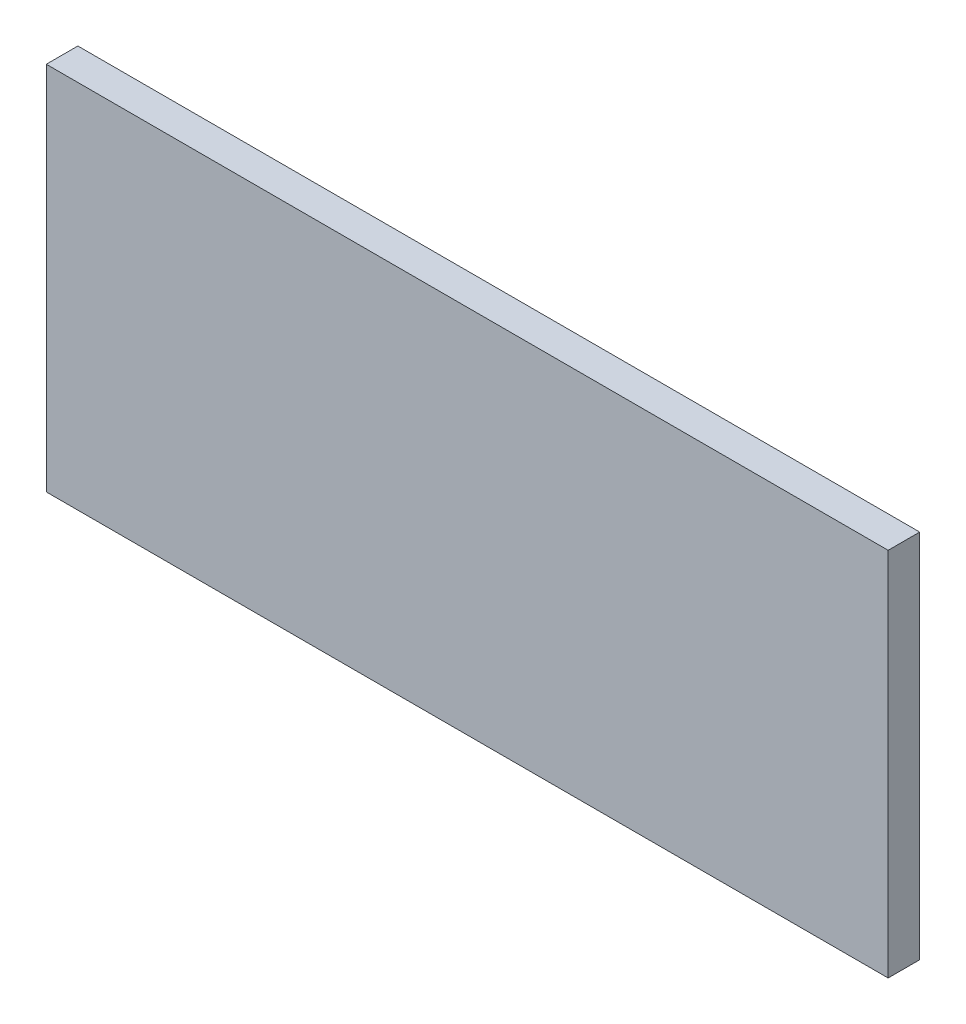
ISO-10303-21;
HEADER;
FILE_DESCRIPTION(('STEP AP214'),'2;1');
FILE_NAME('part.step','',(''),(''),'','','');
FILE_SCHEMA(('AUTOMOTIVE_DESIGN { 1 0 10303 214 1 1 1 1 }'));
ENDSEC;
DATA;
#1=APPLICATION_CONTEXT('core data for automotive mechanical design processes');
#2=APPLICATION_PROTOCOL_DEFINITION('international standard','automotive_design',2000,#1);
#3=PRODUCT_CONTEXT('',#1,'mechanical');
#4=PRODUCT('Part','Part','',(#3));
#5=PRODUCT_RELATED_PRODUCT_CATEGORY('part','',(#4));
#6=PRODUCT_DEFINITION_FORMATION('','',#4);
#7=PRODUCT_DEFINITION_CONTEXT('part definition',#1,'design');
#8=PRODUCT_DEFINITION('design','',#6,#7);
#9=PRODUCT_DEFINITION_SHAPE('','',#8);
#10=(LENGTH_UNIT() NAMED_UNIT(*) SI_UNIT(.MILLI.,.METRE.));
#11=(NAMED_UNIT(*) PLANE_ANGLE_UNIT() SI_UNIT($,.RADIAN.));
#12=(NAMED_UNIT(*) SI_UNIT($,.STERADIAN.) SOLID_ANGLE_UNIT());
#13=UNCERTAINTY_MEASURE_WITH_UNIT(LENGTH_MEASURE(1.E-05),#10,'distance_accuracy_value','');
#14=(GEOMETRIC_REPRESENTATION_CONTEXT(3) GLOBAL_UNCERTAINTY_ASSIGNED_CONTEXT((#13)) GLOBAL_UNIT_ASSIGNED_CONTEXT((#10,
#11,#12)) REPRESENTATION_CONTEXT('',''));
#15=CARTESIAN_POINT('',(0.,0.,0.));
#16=DIRECTION('',(0.,0.,1.));
#17=DIRECTION('',(1.,0.,0.));
#18=AXIS2_PLACEMENT_3D('',#15,#16,#17);
#19=CARTESIAN_POINT('',(-200.,75.5,15.));
#20=DIRECTION('',(0.,-1.,0.));
#21=DIRECTION('',(0.,0.,-1.));
#22=AXIS2_PLACEMENT_3D('',#19,#20,#21);
#23=PLANE('',#22);
#24=DIRECTION('',(-1.,0.,0.));
#25=VECTOR('',#24,1.);
#26=CARTESIAN_POINT('',(-200.,75.5,0.));
#27=LINE('',#26,#25);
#28=CARTESIAN_POINT('',(200.,75.5,0.));
#29=VERTEX_POINT('',#28);
#30=CARTESIAN_POINT('',(-200.,75.5,0.));
#31=VERTEX_POINT('',#30);
#32=EDGE_CURVE('E84',#29,#31,#27,.T.);
#33=ORIENTED_EDGE('',*,*,#32,.T.);
#34=DIRECTION('',(0.,0.,-1.));
#35=VECTOR('',#34,1.);
#36=CARTESIAN_POINT('',(-200.,75.5,15.));
#37=LINE('',#36,#35);
#38=CARTESIAN_POINT('',(-200.,75.5,15.));
#39=VERTEX_POINT('',#38);
#40=EDGE_CURVE('E46',#39,#31,#37,.T.);
#41=ORIENTED_EDGE('',*,*,#40,.F.);
#42=DIRECTION('',(-1.,0.,0.));
#43=VECTOR('',#42,1.);
#44=CARTESIAN_POINT('',(-200.,75.5,15.));
#45=LINE('',#44,#43);
#46=CARTESIAN_POINT('',(200.,75.5,15.));
#47=VERTEX_POINT('',#46);
#48=EDGE_CURVE('E54',#47,#39,#45,.T.);
#49=ORIENTED_EDGE('',*,*,#48,.F.);
#50=DIRECTION('',(0.,0.,-1.));
#51=VECTOR('',#50,1.);
#52=CARTESIAN_POINT('',(200.,75.5,15.));
#53=LINE('',#52,#51);
#54=EDGE_CURVE('E11',#47,#29,#53,.T.);
#55=ORIENTED_EDGE('',*,*,#54,.T.);
#56=EDGE_LOOP('',(#33,#41,#49,#55));
#57=FACE_BOUND('',#56,.T.);
#58=ADVANCED_FACE('F38',(#57),#23,.F.);
#59=CARTESIAN_POINT('',(-200.,-75.5,15.));
#60=DIRECTION('',(1.,0.,0.));
#61=DIRECTION('',(0.,0.,-1.));
#62=AXIS2_PLACEMENT_3D('',#59,#60,#61);
#63=PLANE('',#62);
#64=DIRECTION('',(0.,-1.,0.));
#65=VECTOR('',#64,1.);
#66=CARTESIAN_POINT('',(-200.,-75.5,0.));
#67=LINE('',#66,#65);
#68=CARTESIAN_POINT('',(-200.,-100.5,0.));
#69=VERTEX_POINT('',#68);
#70=EDGE_CURVE('E85',#31,#69,#67,.T.);
#71=ORIENTED_EDGE('',*,*,#70,.T.);
#72=DIRECTION('',(0.,0.,-1.));
#73=VECTOR('',#72,1.);
#74=CARTESIAN_POINT('',(-200.,-100.5,15.));
#75=LINE('',#74,#73);
#76=CARTESIAN_POINT('',(-200.,-100.5,15.));
#77=VERTEX_POINT('',#76);
#78=EDGE_CURVE('E94',#77,#69,#75,.T.);
#79=ORIENTED_EDGE('',*,*,#78,.F.);
#80=DIRECTION('',(0.,-1.,0.));
#81=VECTOR('',#80,1.);
#82=CARTESIAN_POINT('',(-200.,-75.5,15.));
#83=LINE('',#82,#81);
#84=EDGE_CURVE('E146',#39,#77,#83,.T.);
#85=ORIENTED_EDGE('',*,*,#84,.F.);
#86=ORIENTED_EDGE('',*,*,#40,.T.);
#87=EDGE_LOOP('',(#71,#79,#85,#86));
#88=FACE_BOUND('',#87,.T.);
#89=ADVANCED_FACE('F152',(#88),#63,.F.);
#90=CARTESIAN_POINT('',(200.,-85.5,15.));
#91=DIRECTION('',(-1.,0.,0.));
#92=DIRECTION('',(0.,0.,1.));
#93=AXIS2_PLACEMENT_3D('',#90,#91,#92);
#94=PLANE('',#93);
#95=DIRECTION('',(0.,1.,0.));
#96=VECTOR('',#95,1.);
#97=CARTESIAN_POINT('',(200.,-85.5,0.));
#98=LINE('',#97,#96);
#99=CARTESIAN_POINT('',(200.,-100.5,0.));
#100=VERTEX_POINT('',#99);
#101=EDGE_CURVE('E65',#100,#29,#98,.T.);
#102=ORIENTED_EDGE('',*,*,#101,.T.);
#103=ORIENTED_EDGE('',*,*,#54,.F.);
#104=DIRECTION('',(0.,1.,0.));
#105=VECTOR('',#104,1.);
#106=CARTESIAN_POINT('',(200.,-75.5,15.));
#107=LINE('',#106,#105);
#108=CARTESIAN_POINT('',(200.,-100.5,15.));
#109=VERTEX_POINT('',#108);
#110=EDGE_CURVE('E71',#109,#47,#107,.T.);
#111=ORIENTED_EDGE('',*,*,#110,.F.);
#112=DIRECTION('',(0.,0.,-1.));
#113=VECTOR('',#112,1.);
#114=CARTESIAN_POINT('',(200.,-100.5,15.));
#115=LINE('',#114,#113);
#116=EDGE_CURVE('E92',#109,#100,#115,.T.);
#117=ORIENTED_EDGE('',*,*,#116,.T.);
#118=EDGE_LOOP('',(#102,#103,#111,#117));
#119=FACE_BOUND('',#118,.T.);
#120=ADVANCED_FACE('F97',(#119),#94,.F.);
#121=CARTESIAN_POINT('',(0.,0.,15.));
#122=DIRECTION('',(0.,0.,-1.));
#123=DIRECTION('',(-1.,0.,0.));
#124=AXIS2_PLACEMENT_3D('',#121,#122,#123);
#125=PLANE('',#124);
#126=ORIENTED_EDGE('',*,*,#110,.T.);
#127=ORIENTED_EDGE('',*,*,#48,.T.);
#128=ORIENTED_EDGE('',*,*,#84,.T.);
#129=DIRECTION('',(1.,0.,0.));
#130=VECTOR('',#129,1.);
#131=CARTESIAN_POINT('',(-200.,-100.5,15.));
#132=LINE('',#131,#130);
#133=EDGE_CURVE('E95',#77,#109,#132,.T.);
#134=ORIENTED_EDGE('',*,*,#133,.T.);
#135=EDGE_LOOP('',(#126,#127,#128,#134));
#136=FACE_BOUND('',#135,.T.);
#137=ADVANCED_FACE('F154',(#136),#125,.F.);
#138=CARTESIAN_POINT('',(0.,0.,0.));
#139=DIRECTION('',(0.,0.,-1.));
#140=DIRECTION('',(-1.,0.,0.));
#141=AXIS2_PLACEMENT_3D('',#138,#139,#140);
#142=PLANE('',#141);
#143=CARTESIAN_POINT('',(-164.5,-45.5,0.));
#144=DIRECTION('',(0.,0.,1.));
#145=DIRECTION('',(1.,0.,0.));
#146=AXIS2_PLACEMENT_3D('',#143,#144,#145);
#147=CIRCLE('',#146,3.99999999999999);
#148=CARTESIAN_POINT('',(-160.5,-45.5,0.));
#149=VERTEX_POINT('',#148);
#150=EDGE_CURVE('E99',#149,#149,#147,.T.);
#151=ORIENTED_EDGE('',*,*,#150,.T.);
#152=EDGE_LOOP('',(#151));
#153=FACE_BOUND('',#152,.T.);
#154=CARTESIAN_POINT('',(-164.5,60.5,0.));
#155=DIRECTION('',(0.,0.,1.));
#156=DIRECTION('',(1.,0.,0.));
#157=AXIS2_PLACEMENT_3D('',#154,#155,#156);
#158=CIRCLE('',#157,3.99999999999999);
#159=CARTESIAN_POINT('',(-160.5,60.5,0.));
#160=VERTEX_POINT('',#159);
#161=EDGE_CURVE('E106',#160,#160,#158,.T.);
#162=ORIENTED_EDGE('',*,*,#161,.T.);
#163=EDGE_LOOP('',(#162));
#164=FACE_BOUND('',#163,.T.);
#165=CARTESIAN_POINT('',(164.5,-45.5,0.));
#166=DIRECTION('',(0.,0.,-1.));
#167=DIRECTION('',(-1.,0.,0.));
#168=AXIS2_PLACEMENT_3D('',#165,#166,#167);
#169=CIRCLE('',#168,3.99999999999999);
#170=CARTESIAN_POINT('',(160.5,-45.5,0.));
#171=VERTEX_POINT('',#170);
#172=EDGE_CURVE('E112',#171,#171,#169,.T.);
#173=ORIENTED_EDGE('',*,*,#172,.F.);
#174=EDGE_LOOP('',(#173));
#175=FACE_BOUND('',#174,.T.);
#176=CARTESIAN_POINT('',(164.5,60.5,0.));
#177=DIRECTION('',(0.,0.,-1.));
#178=DIRECTION('',(-1.,0.,0.));
#179=AXIS2_PLACEMENT_3D('',#176,#177,#178);
#180=CIRCLE('',#179,3.99999999999999);
#181=CARTESIAN_POINT('',(160.5,60.5,0.));
#182=VERTEX_POINT('',#181);
#183=EDGE_CURVE('E118',#182,#182,#180,.T.);
#184=ORIENTED_EDGE('',*,*,#183,.F.);
#185=EDGE_LOOP('',(#184));
#186=FACE_BOUND('',#185,.T.);
#187=CARTESIAN_POINT('',(-142.,-68.,0.));
#188=DIRECTION('',(0.,0.,-1.));
#189=DIRECTION('',(-1.,0.,0.));
#190=AXIS2_PLACEMENT_3D('',#187,#188,#189);
#191=CIRCLE('',#190,3.99999999999999);
#192=CARTESIAN_POINT('',(-146.,-68.,0.));
#193=VERTEX_POINT('',#192);
#194=EDGE_CURVE('E124',#193,#193,#191,.T.);
#195=ORIENTED_EDGE('',*,*,#194,.F.);
#196=EDGE_LOOP('',(#195));
#197=FACE_BOUND('',#196,.T.);
#198=CARTESIAN_POINT('',(0.,-68.,0.));
#199=DIRECTION('',(0.,0.,-1.));
#200=DIRECTION('',(-1.,0.,0.));
#201=AXIS2_PLACEMENT_3D('',#198,#199,#200);
#202=CIRCLE('',#201,3.99999999999999);
#203=CARTESIAN_POINT('',(-4.00000000000002,-68.,0.));
#204=VERTEX_POINT('',#203);
#205=EDGE_CURVE('E132',#204,#204,#202,.T.);
#206=ORIENTED_EDGE('',*,*,#205,.F.);
#207=EDGE_LOOP('',(#206));
#208=FACE_BOUND('',#207,.T.);
#209=CARTESIAN_POINT('',(142.,-68.,0.));
#210=DIRECTION('',(0.,0.,-1.));
#211=DIRECTION('',(-1.,0.,0.));
#212=AXIS2_PLACEMENT_3D('',#209,#210,#211);
#213=CIRCLE('',#212,3.99999999999999);
#214=CARTESIAN_POINT('',(138.,-68.,0.));
#215=VERTEX_POINT('',#214);
#216=EDGE_CURVE('E138',#215,#215,#213,.T.);
#217=ORIENTED_EDGE('',*,*,#216,.F.);
#218=EDGE_LOOP('',(#217));
#219=FACE_BOUND('',#218,.T.);
#220=ORIENTED_EDGE('',*,*,#32,.F.);
#221=ORIENTED_EDGE('',*,*,#101,.F.);
#222=DIRECTION('',(1.,0.,0.));
#223=VECTOR('',#222,1.);
#224=CARTESIAN_POINT('',(-200.,-100.5,0.));
#225=LINE('',#224,#223);
#226=EDGE_CURVE('E82',#69,#100,#225,.T.);
#227=ORIENTED_EDGE('',*,*,#226,.F.);
#228=ORIENTED_EDGE('',*,*,#70,.F.);
#229=EDGE_LOOP('',(#220,#221,#227,#228));
#230=FACE_BOUND('',#229,.T.);
#231=ADVANCED_FACE('F81',(#153,#164,#175,#186,#197,#208,#219,#230),#142,.T.);
#232=CARTESIAN_POINT('',(142.,-68.,10.));
#233=DIRECTION('',(0.,0.,-1.));
#234=DIRECTION('',(-1.,0.,0.));
#235=AXIS2_PLACEMENT_3D('',#232,#233,#234);
#236=CYLINDRICAL_SURFACE('',#235,3.99999999999999);
#237=CARTESIAN_POINT('',(142.,-68.,10.));
#238=DIRECTION('',(0.,0.,-1.));
#239=DIRECTION('',(-1.,0.,0.));
#240=AXIS2_PLACEMENT_3D('',#237,#238,#239);
#241=CIRCLE('',#240,3.99999999999999);
#242=CARTESIAN_POINT('',(138.,-68.,10.));
#243=VERTEX_POINT('',#242);
#244=EDGE_CURVE('E139',#243,#243,#241,.T.);
#245=ORIENTED_EDGE('',*,*,#244,.F.);
#246=EDGE_LOOP('',(#245));
#247=FACE_BOUND('',#246,.T.);
#248=ORIENTED_EDGE('',*,*,#216,.T.);
#249=EDGE_LOOP('',(#248));
#250=FACE_BOUND('',#249,.T.);
#251=ADVANCED_FACE('F161',(#247,#250),#236,.F.);
#252=CARTESIAN_POINT('',(142.,-68.,10.));
#253=DIRECTION('',(0.,0.,-1.));
#254=DIRECTION('',(-1.,0.,0.));
#255=AXIS2_PLACEMENT_3D('',#252,#253,#254);
#256=PLANE('',#255);
#257=ORIENTED_EDGE('',*,*,#244,.T.);
#258=EDGE_LOOP('',(#257));
#259=FACE_BOUND('',#258,.T.);
#260=ADVANCED_FACE('F296',(#259),#256,.T.);
#261=CARTESIAN_POINT('',(0.,-68.,10.));
#262=DIRECTION('',(0.,0.,-1.));
#263=DIRECTION('',(-1.,0.,0.));
#264=AXIS2_PLACEMENT_3D('',#261,#262,#263);
#265=CYLINDRICAL_SURFACE('',#264,3.99999999999999);
#266=CARTESIAN_POINT('',(0.,-68.,10.));
#267=DIRECTION('',(0.,0.,-1.));
#268=DIRECTION('',(-1.,0.,0.));
#269=AXIS2_PLACEMENT_3D('',#266,#267,#268);
#270=CIRCLE('',#269,3.99999999999999);
#271=CARTESIAN_POINT('',(-4.00000000000002,-68.,10.));
#272=VERTEX_POINT('',#271);
#273=EDGE_CURVE('E135',#272,#272,#270,.T.);
#274=ORIENTED_EDGE('',*,*,#273,.F.);
#275=EDGE_LOOP('',(#274));
#276=FACE_BOUND('',#275,.T.);
#277=ORIENTED_EDGE('',*,*,#205,.T.);
#278=EDGE_LOOP('',(#277));
#279=FACE_BOUND('',#278,.T.);
#280=ADVANCED_FACE('F288',(#276,#279),#265,.F.);
#281=CARTESIAN_POINT('',(0.,-68.,10.));
#282=DIRECTION('',(0.,0.,-1.));
#283=DIRECTION('',(-1.,0.,0.));
#284=AXIS2_PLACEMENT_3D('',#281,#282,#283);
#285=PLANE('',#284);
#286=ORIENTED_EDGE('',*,*,#273,.T.);
#287=EDGE_LOOP('',(#286));
#288=FACE_BOUND('',#287,.T.);
#289=ADVANCED_FACE('F280',(#288),#285,.T.);
#290=CARTESIAN_POINT('',(-142.,-68.,10.));
#291=DIRECTION('',(0.,0.,-1.));
#292=DIRECTION('',(-1.,0.,0.));
#293=AXIS2_PLACEMENT_3D('',#290,#291,#292);
#294=CYLINDRICAL_SURFACE('',#293,3.99999999999999);
#295=CARTESIAN_POINT('',(-142.,-68.,10.));
#296=DIRECTION('',(0.,0.,-1.));
#297=DIRECTION('',(-1.,0.,0.));
#298=AXIS2_PLACEMENT_3D('',#295,#296,#297);
#299=CIRCLE('',#298,3.99999999999999);
#300=CARTESIAN_POINT('',(-146.,-68.,10.));
#301=VERTEX_POINT('',#300);
#302=EDGE_CURVE('E129',#301,#301,#299,.T.);
#303=ORIENTED_EDGE('',*,*,#302,.F.);
#304=EDGE_LOOP('',(#303));
#305=FACE_BOUND('',#304,.T.);
#306=ORIENTED_EDGE('',*,*,#194,.T.);
#307=EDGE_LOOP('',(#306));
#308=FACE_BOUND('',#307,.T.);
#309=ADVANCED_FACE('F272',(#305,#308),#294,.F.);
#310=CARTESIAN_POINT('',(-142.,-68.,10.));
#311=DIRECTION('',(0.,0.,-1.));
#312=DIRECTION('',(-1.,0.,0.));
#313=AXIS2_PLACEMENT_3D('',#310,#311,#312);
#314=PLANE('',#313);
#315=ORIENTED_EDGE('',*,*,#302,.T.);
#316=EDGE_LOOP('',(#315));
#317=FACE_BOUND('',#316,.T.);
#318=ADVANCED_FACE('F264',(#317),#314,.T.);
#319=CARTESIAN_POINT('',(164.5,60.5,10.));
#320=DIRECTION('',(0.,0.,-1.));
#321=DIRECTION('',(-1.,0.,0.));
#322=AXIS2_PLACEMENT_3D('',#319,#320,#321);
#323=CYLINDRICAL_SURFACE('',#322,3.99999999999999);
#324=CARTESIAN_POINT('',(164.5,60.5,10.));
#325=DIRECTION('',(0.,0.,-1.));
#326=DIRECTION('',(-1.,0.,0.));
#327=AXIS2_PLACEMENT_3D('',#324,#325,#326);
#328=CIRCLE('',#327,3.99999999999999);
#329=CARTESIAN_POINT('',(160.5,60.5,10.));
#330=VERTEX_POINT('',#329);
#331=EDGE_CURVE('E121',#330,#330,#328,.T.);
#332=ORIENTED_EDGE('',*,*,#331,.F.);
#333=EDGE_LOOP('',(#332));
#334=FACE_BOUND('',#333,.T.);
#335=ORIENTED_EDGE('',*,*,#183,.T.);
#336=EDGE_LOOP('',(#335));
#337=FACE_BOUND('',#336,.T.);
#338=ADVANCED_FACE('F256',(#334,#337),#323,.F.);
#339=CARTESIAN_POINT('',(164.5,60.5,10.));
#340=DIRECTION('',(0.,0.,-1.));
#341=DIRECTION('',(-1.,0.,0.));
#342=AXIS2_PLACEMENT_3D('',#339,#340,#341);
#343=PLANE('',#342);
#344=ORIENTED_EDGE('',*,*,#331,.T.);
#345=EDGE_LOOP('',(#344));
#346=FACE_BOUND('',#345,.T.);
#347=ADVANCED_FACE('F248',(#346),#343,.T.);
#348=CARTESIAN_POINT('',(164.5,-45.5,10.));
#349=DIRECTION('',(0.,0.,-1.));
#350=DIRECTION('',(-1.,0.,0.));
#351=AXIS2_PLACEMENT_3D('',#348,#349,#350);
#352=CYLINDRICAL_SURFACE('',#351,3.99999999999999);
#353=CARTESIAN_POINT('',(164.5,-45.5,10.));
#354=DIRECTION('',(0.,0.,-1.));
#355=DIRECTION('',(-1.,0.,0.));
#356=AXIS2_PLACEMENT_3D('',#353,#354,#355);
#357=CIRCLE('',#356,3.99999999999999);
#358=CARTESIAN_POINT('',(160.5,-45.5,10.));
#359=VERTEX_POINT('',#358);
#360=EDGE_CURVE('E115',#359,#359,#357,.T.);
#361=ORIENTED_EDGE('',*,*,#360,.F.);
#362=EDGE_LOOP('',(#361));
#363=FACE_BOUND('',#362,.T.);
#364=ORIENTED_EDGE('',*,*,#172,.T.);
#365=EDGE_LOOP('',(#364));
#366=FACE_BOUND('',#365,.T.);
#367=ADVANCED_FACE('F240',(#363,#366),#352,.F.);
#368=CARTESIAN_POINT('',(164.5,-45.5,10.));
#369=DIRECTION('',(0.,0.,-1.));
#370=DIRECTION('',(-1.,0.,0.));
#371=AXIS2_PLACEMENT_3D('',#368,#369,#370);
#372=PLANE('',#371);
#373=ORIENTED_EDGE('',*,*,#360,.T.);
#374=EDGE_LOOP('',(#373));
#375=FACE_BOUND('',#374,.T.);
#376=ADVANCED_FACE('F232',(#375),#372,.T.);
#377=CARTESIAN_POINT('',(-164.5,60.5,10.));
#378=DIRECTION('',(0.,0.,-1.));
#379=DIRECTION('',(-1.,0.,0.));
#380=AXIS2_PLACEMENT_3D('',#377,#378,#379);
#381=CYLINDRICAL_SURFACE('',#380,3.99999999999999);
#382=CARTESIAN_POINT('',(-164.5,60.5,10.));
#383=DIRECTION('',(0.,0.,1.));
#384=DIRECTION('',(1.,0.,0.));
#385=AXIS2_PLACEMENT_3D('',#382,#383,#384);
#386=CIRCLE('',#385,3.99999999999999);
#387=CARTESIAN_POINT('',(-160.5,60.5,10.));
#388=VERTEX_POINT('',#387);
#389=EDGE_CURVE('E109',#388,#388,#386,.T.);
#390=ORIENTED_EDGE('',*,*,#389,.T.);
#391=EDGE_LOOP('',(#390));
#392=FACE_BOUND('',#391,.T.);
#393=ORIENTED_EDGE('',*,*,#161,.F.);
#394=EDGE_LOOP('',(#393));
#395=FACE_BOUND('',#394,.T.);
#396=ADVANCED_FACE('F224',(#392,#395),#381,.F.);
#397=CARTESIAN_POINT('',(-164.5,60.5,10.));
#398=DIRECTION('',(0.,0.,-1.));
#399=DIRECTION('',(1.,0.,0.));
#400=AXIS2_PLACEMENT_3D('',#397,#398,#399);
#401=PLANE('',#400);
#402=ORIENTED_EDGE('',*,*,#389,.F.);
#403=EDGE_LOOP('',(#402));
#404=FACE_BOUND('',#403,.T.);
#405=ADVANCED_FACE('F216',(#404),#401,.T.);
#406=CARTESIAN_POINT('',(-164.5,-45.5,10.));
#407=DIRECTION('',(0.,0.,-1.));
#408=DIRECTION('',(-1.,0.,0.));
#409=AXIS2_PLACEMENT_3D('',#406,#407,#408);
#410=CYLINDRICAL_SURFACE('',#409,3.99999999999999);
#411=CARTESIAN_POINT('',(-164.5,-45.5,10.));
#412=DIRECTION('',(0.,0.,1.));
#413=DIRECTION('',(1.,0.,0.));
#414=AXIS2_PLACEMENT_3D('',#411,#412,#413);
#415=CIRCLE('',#414,3.99999999999999);
#416=CARTESIAN_POINT('',(-160.5,-45.5,10.));
#417=VERTEX_POINT('',#416);
#418=EDGE_CURVE('E103',#417,#417,#415,.T.);
#419=ORIENTED_EDGE('',*,*,#418,.T.);
#420=EDGE_LOOP('',(#419));
#421=FACE_BOUND('',#420,.T.);
#422=ORIENTED_EDGE('',*,*,#150,.F.);
#423=EDGE_LOOP('',(#422));
#424=FACE_BOUND('',#423,.T.);
#425=ADVANCED_FACE('F208',(#421,#424),#410,.F.);
#426=CARTESIAN_POINT('',(-164.5,-45.5,10.));
#427=DIRECTION('',(0.,0.,-1.));
#428=DIRECTION('',(1.,0.,0.));
#429=AXIS2_PLACEMENT_3D('',#426,#427,#428);
#430=PLANE('',#429);
#431=ORIENTED_EDGE('',*,*,#418,.F.);
#432=EDGE_LOOP('',(#431));
#433=FACE_BOUND('',#432,.T.);
#434=ADVANCED_FACE('F199',(#433),#430,.T.);
#435=CARTESIAN_POINT('',(-200.,-100.5,15.));
#436=DIRECTION('',(0.,1.,0.));
#437=DIRECTION('',(0.,0.,1.));
#438=AXIS2_PLACEMENT_3D('',#435,#436,#437);
#439=PLANE('',#438);
#440=ORIENTED_EDGE('',*,*,#226,.T.);
#441=ORIENTED_EDGE('',*,*,#116,.F.);
#442=ORIENTED_EDGE('',*,*,#133,.F.);
#443=ORIENTED_EDGE('',*,*,#78,.T.);
#444=EDGE_LOOP('',(#440,#441,#442,#443));
#445=FACE_BOUND('',#444,.T.);
#446=ADVANCED_FACE('F90',(#445),#439,.F.);
#447=CLOSED_SHELL('',(#58,#89,#120,#137,#231,#251,#260,#280,#289,#309,#318,#338,#347,#367,#376,
#396,#405,#425,#434,#446));
#448=MANIFOLD_SOLID_BREP('B2',#447);
#449=ADVANCED_BREP_SHAPE_REPRESENTATION('',(#18,#448),#14);
#450=SHAPE_DEFINITION_REPRESENTATION(#9,#449);
ENDSEC;
END-ISO-10303-21;
